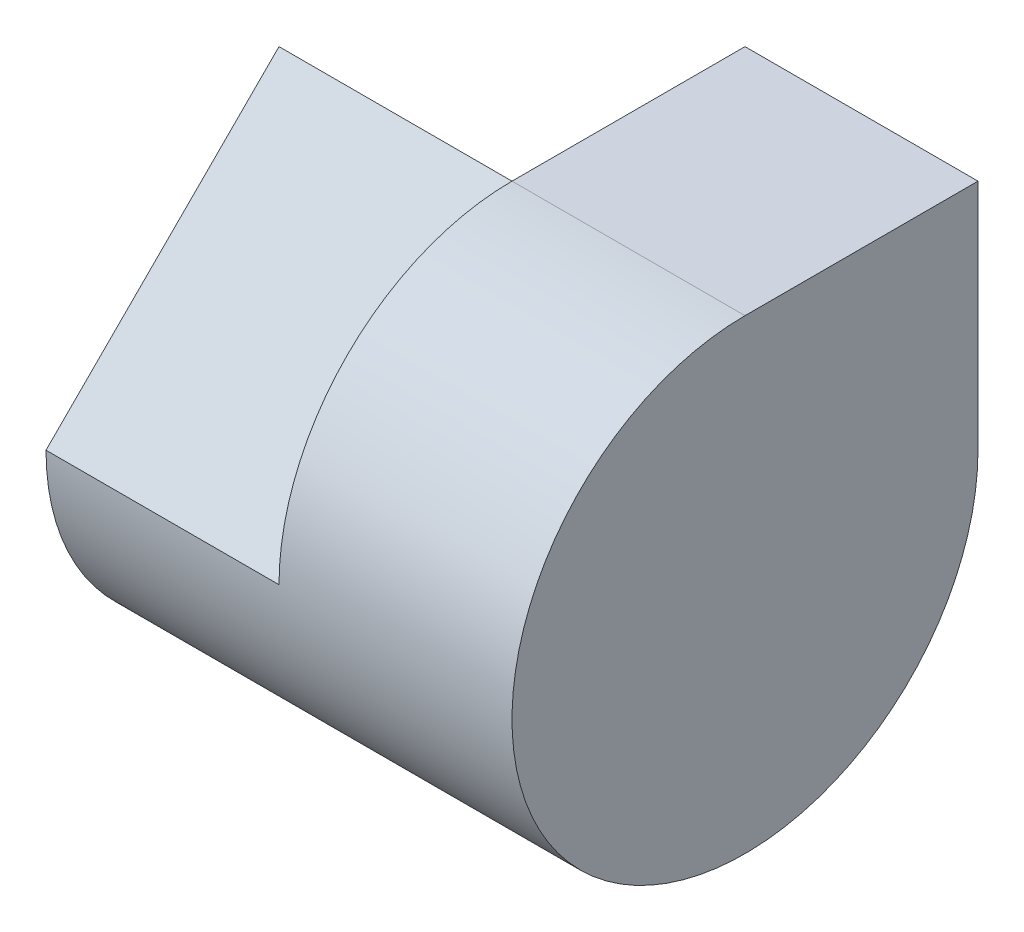
ISO-10303-21;
HEADER;
FILE_DESCRIPTION(('STEP AP214'),'2;1');
FILE_NAME('part.step','',(''),(''),'','','');
FILE_SCHEMA(('AUTOMOTIVE_DESIGN { 1 0 10303 214 1 1 1 1 }'));
ENDSEC;
DATA;
#1=APPLICATION_CONTEXT('core data for automotive mechanical design processes');
#2=APPLICATION_PROTOCOL_DEFINITION('international standard','automotive_design',2000,#1);
#3=PRODUCT_CONTEXT('',#1,'mechanical');
#4=PRODUCT('Part','Part','',(#3));
#5=PRODUCT_RELATED_PRODUCT_CATEGORY('part','',(#4));
#6=PRODUCT_DEFINITION_FORMATION('','',#4);
#7=PRODUCT_DEFINITION_CONTEXT('part definition',#1,'design');
#8=PRODUCT_DEFINITION('design','',#6,#7);
#9=PRODUCT_DEFINITION_SHAPE('','',#8);
#10=(LENGTH_UNIT() NAMED_UNIT(*) SI_UNIT(.MILLI.,.METRE.));
#11=(NAMED_UNIT(*) PLANE_ANGLE_UNIT() SI_UNIT($,.RADIAN.));
#12=(NAMED_UNIT(*) SI_UNIT($,.STERADIAN.) SOLID_ANGLE_UNIT());
#13=UNCERTAINTY_MEASURE_WITH_UNIT(LENGTH_MEASURE(1.E-05),#10,'distance_accuracy_value','');
#14=(GEOMETRIC_REPRESENTATION_CONTEXT(3) GLOBAL_UNCERTAINTY_ASSIGNED_CONTEXT((#13)) GLOBAL_UNIT_ASSIGNED_CONTEXT((#10,
#11,#12)) REPRESENTATION_CONTEXT('',''));
#15=CARTESIAN_POINT('',(0.,0.,0.));
#16=DIRECTION('',(0.,0.,1.));
#17=DIRECTION('',(1.,0.,0.));
#18=AXIS2_PLACEMENT_3D('',#15,#16,#17);
#19=CARTESIAN_POINT('',(-2.,4.,2.));
#20=DIRECTION('',(1.,0.,0.));
#21=DIRECTION('',(0.,0.,-1.));
#22=AXIS2_PLACEMENT_3D('',#19,#20,#21);
#23=PLANE('',#22);
#24=CARTESIAN_POINT('',(-2.,2.,0.));
#25=DIRECTION('',(1.,0.,0.));
#26=DIRECTION('',(0.,0.,-1.));
#27=AXIS2_PLACEMENT_3D('',#24,#25,#26);
#28=CIRCLE('',#27,2.);
#29=CARTESIAN_POINT('',(-2.,2.,-2.));
#30=VERTEX_POINT('',#29);
#31=CARTESIAN_POINT('',(-2.,2.,2.));
#32=VERTEX_POINT('',#31);
#33=EDGE_CURVE('E140',#30,#32,#28,.F.);
#34=ORIENTED_EDGE('',*,*,#33,.T.);
#35=DIRECTION('',(0.,0.707106781186548,-0.707106781186548));
#36=VECTOR('',#35,1.);
#37=CARTESIAN_POINT('',(-2.,2.,2.));
#38=LINE('',#37,#36);
#39=CARTESIAN_POINT('',(-2.,4.,0.));
#40=VERTEX_POINT('',#39);
#41=EDGE_CURVE('E135',#32,#40,#38,.T.);
#42=ORIENTED_EDGE('',*,*,#41,.T.);
#43=DIRECTION('',(0.,-1.,0.));
#44=VECTOR('',#43,1.);
#45=CARTESIAN_POINT('',(-2.,0.,0.));
#46=LINE('',#45,#44);
#47=CARTESIAN_POINT('',(-2.,2.,0.));
#48=VERTEX_POINT('',#47);
#49=EDGE_CURVE('E149',#40,#48,#46,.T.);
#50=ORIENTED_EDGE('',*,*,#49,.T.);
#51=DIRECTION('',(0.,0.,-1.));
#52=VECTOR('',#51,1.);
#53=CARTESIAN_POINT('',(-2.,2.,0.));
#54=LINE('',#53,#52);
#55=EDGE_CURVE('E136',#48,#30,#54,.T.);
#56=ORIENTED_EDGE('',*,*,#55,.T.);
#57=EDGE_LOOP('',(#34,#42,#50,#56));
#58=FACE_BOUND('',#57,.T.);
#59=ADVANCED_FACE('F72',(#58),#23,.F.);
#60=CARTESIAN_POINT('',(2.,4.,2.));
#61=DIRECTION('',(-1.,0.,0.));
#62=DIRECTION('',(0.,0.,1.));
#63=AXIS2_PLACEMENT_3D('',#60,#61,#62);
#64=PLANE('',#63);
#65=DIRECTION('',(0.,0.,-1.));
#66=VECTOR('',#65,1.);
#67=CARTESIAN_POINT('',(2.,4.,2.));
#68=LINE('',#67,#66);
#69=CARTESIAN_POINT('',(2.,4.,0.));
#70=VERTEX_POINT('',#69);
#71=CARTESIAN_POINT('',(2.,4.,-2.));
#72=VERTEX_POINT('',#71);
#73=EDGE_CURVE('E93',#70,#72,#68,.T.);
#74=ORIENTED_EDGE('',*,*,#73,.F.);
#75=CARTESIAN_POINT('',(2.,2.,0.));
#76=DIRECTION('',(-1.,0.,0.));
#77=DIRECTION('',(0.,0.,1.));
#78=AXIS2_PLACEMENT_3D('',#75,#76,#77);
#79=CIRCLE('',#78,2.);
#80=CARTESIAN_POINT('',(2.,2.,-2.));
#81=VERTEX_POINT('',#80);
#82=EDGE_CURVE('E178',#70,#81,#79,.F.);
#83=ORIENTED_EDGE('',*,*,#82,.T.);
#84=DIRECTION('',(0.,-1.,0.));
#85=VECTOR('',#84,1.);
#86=CARTESIAN_POINT('',(2.,4.,-2.));
#87=LINE('',#86,#85);
#88=EDGE_CURVE('E80',#72,#81,#87,.T.);
#89=ORIENTED_EDGE('',*,*,#88,.F.);
#90=EDGE_LOOP('',(#74,#83,#89));
#91=FACE_BOUND('',#90,.T.);
#92=ADVANCED_FACE('F74',(#91),#64,.F.);
#93=CARTESIAN_POINT('',(-2.,4.,-2.));
#94=DIRECTION('',(0.,0.,1.));
#95=DIRECTION('',(1.,0.,0.));
#96=AXIS2_PLACEMENT_3D('',#93,#94,#95);
#97=PLANE('',#96);
#98=DIRECTION('',(-1.,0.,0.));
#99=VECTOR('',#98,1.);
#100=CARTESIAN_POINT('',(20.,2.,-2.));
#101=LINE('',#100,#99);
#102=CARTESIAN_POINT('',(0.,2.,-2.));
#103=VERTEX_POINT('',#102);
#104=EDGE_CURVE('E175',#81,#103,#101,.T.);
#105=ORIENTED_EDGE('',*,*,#104,.T.);
#106=DIRECTION('',(0.,-1.,0.));
#107=VECTOR('',#106,1.);
#108=CARTESIAN_POINT('',(0.,0.,-2.));
#109=LINE('',#108,#107);
#110=CARTESIAN_POINT('',(0.,4.,-2.));
#111=VERTEX_POINT('',#110);
#112=EDGE_CURVE('E153',#111,#103,#109,.T.);
#113=ORIENTED_EDGE('',*,*,#112,.F.);
#114=DIRECTION('',(-1.,0.,0.));
#115=VECTOR('',#114,1.);
#116=CARTESIAN_POINT('',(-2.,4.,-2.));
#117=LINE('',#116,#115);
#118=EDGE_CURVE('E168',#72,#111,#117,.T.);
#119=ORIENTED_EDGE('',*,*,#118,.F.);
#120=ORIENTED_EDGE('',*,*,#88,.T.);
#121=EDGE_LOOP('',(#105,#113,#119,#120));
#122=FACE_BOUND('',#121,.T.);
#123=ADVANCED_FACE('F173',(#122),#97,.F.);
#124=CARTESIAN_POINT('',(0.,0.,0.));
#125=DIRECTION('',(-1.,0.,0.));
#126=DIRECTION('',(0.,0.,1.));
#127=AXIS2_PLACEMENT_3D('',#124,#125,#126);
#128=PLANE('',#127);
#129=CARTESIAN_POINT('',(0.,2.,0.));
#130=DIRECTION('',(-1.,0.,0.));
#131=DIRECTION('',(0.,0.,1.));
#132=AXIS2_PLACEMENT_3D('',#129,#130,#131);
#133=CIRCLE('',#132,2.);
#134=CARTESIAN_POINT('',(0.,4.,0.));
#135=VERTEX_POINT('',#134);
#136=CARTESIAN_POINT('',(0.,2.,2.));
#137=VERTEX_POINT('',#136);
#138=EDGE_CURVE('E12',#135,#137,#133,.F.);
#139=ORIENTED_EDGE('',*,*,#138,.F.);
#140=DIRECTION('',(0.,0.707106781186548,-0.707106781186548));
#141=VECTOR('',#140,1.);
#142=CARTESIAN_POINT('',(0.,2.,2.));
#143=LINE('',#142,#141);
#144=EDGE_CURVE('E132',#137,#135,#143,.T.);
#145=ORIENTED_EDGE('',*,*,#144,.F.);
#146=EDGE_LOOP('',(#139,#145));
#147=FACE_BOUND('',#146,.T.);
#148=ADVANCED_FACE('F138',(#147),#128,.T.);
#149=CARTESIAN_POINT('',(0.,4.,0.));
#150=DIRECTION('',(0.,-1.,0.));
#151=DIRECTION('',(0.,0.,-1.));
#152=AXIS2_PLACEMENT_3D('',#149,#150,#151);
#153=PLANE('',#152);
#154=DIRECTION('',(0.,0.,-1.));
#155=VECTOR('',#154,1.);
#156=CARTESIAN_POINT('',(0.,4.,0.));
#157=LINE('',#156,#155);
#158=EDGE_CURVE('E151',#135,#111,#157,.T.);
#159=ORIENTED_EDGE('',*,*,#158,.F.);
#160=DIRECTION('',(-1.,0.,0.));
#161=VECTOR('',#160,1.);
#162=CARTESIAN_POINT('',(20.,4.,0.));
#163=LINE('',#162,#161);
#164=EDGE_CURVE('E86',#70,#135,#163,.T.);
#165=ORIENTED_EDGE('',*,*,#164,.F.);
#166=ORIENTED_EDGE('',*,*,#73,.T.);
#167=ORIENTED_EDGE('',*,*,#118,.T.);
#168=EDGE_LOOP('',(#159,#165,#166,#167));
#169=FACE_BOUND('',#168,.T.);
#170=ADVANCED_FACE('F191',(#169),#153,.F.);
#171=CARTESIAN_POINT('',(0.,2.,0.));
#172=DIRECTION('',(0.,1.,0.));
#173=DIRECTION('',(0.,0.,1.));
#174=AXIS2_PLACEMENT_3D('',#171,#172,#173);
#175=PLANE('',#174);
#176=ORIENTED_EDGE('',*,*,#55,.F.);
#177=DIRECTION('',(-1.,0.,0.));
#178=VECTOR('',#177,1.);
#179=CARTESIAN_POINT('',(0.,2.,0.));
#180=LINE('',#179,#178);
#181=CARTESIAN_POINT('',(0.,2.,0.));
#182=VERTEX_POINT('',#181);
#183=EDGE_CURVE('E156',#182,#48,#180,.T.);
#184=ORIENTED_EDGE('',*,*,#183,.F.);
#185=DIRECTION('',(0.,0.,-1.));
#186=VECTOR('',#185,1.);
#187=CARTESIAN_POINT('',(0.,2.,0.));
#188=LINE('',#187,#186);
#189=EDGE_CURVE('E145',#182,#103,#188,.T.);
#190=ORIENTED_EDGE('',*,*,#189,.T.);
#191=DIRECTION('',(-1.,0.,0.));
#192=VECTOR('',#191,1.);
#193=CARTESIAN_POINT('',(0.,2.,-2.));
#194=LINE('',#193,#192);
#195=EDGE_CURVE('E161',#103,#30,#194,.T.);
#196=ORIENTED_EDGE('',*,*,#195,.T.);
#197=EDGE_LOOP('',(#176,#184,#190,#196));
#198=FACE_BOUND('',#197,.T.);
#199=ADVANCED_FACE('F185',(#198),#175,.T.);
#200=CARTESIAN_POINT('',(0.,0.,0.));
#201=DIRECTION('',(0.,0.,-1.));
#202=DIRECTION('',(-1.,0.,0.));
#203=AXIS2_PLACEMENT_3D('',#200,#201,#202);
#204=PLANE('',#203);
#205=ORIENTED_EDGE('',*,*,#49,.F.);
#206=DIRECTION('',(-1.,0.,0.));
#207=VECTOR('',#206,1.);
#208=CARTESIAN_POINT('',(0.,4.,0.));
#209=LINE('',#208,#207);
#210=EDGE_CURVE('E164',#135,#40,#209,.T.);
#211=ORIENTED_EDGE('',*,*,#210,.F.);
#212=DIRECTION('',(0.,-1.,0.));
#213=VECTOR('',#212,1.);
#214=CARTESIAN_POINT('',(0.,0.,0.));
#215=LINE('',#214,#213);
#216=EDGE_CURVE('E148',#135,#182,#215,.T.);
#217=ORIENTED_EDGE('',*,*,#216,.T.);
#218=ORIENTED_EDGE('',*,*,#183,.T.);
#219=EDGE_LOOP('',(#205,#211,#217,#218));
#220=FACE_BOUND('',#219,.T.);
#221=ADVANCED_FACE('F199',(#220),#204,.T.);
#222=CARTESIAN_POINT('',(0.,0.,0.));
#223=DIRECTION('',(-1.,0.,0.));
#224=DIRECTION('',(0.,0.,1.));
#225=AXIS2_PLACEMENT_3D('',#222,#223,#224);
#226=PLANE('',#225);
#227=ORIENTED_EDGE('',*,*,#189,.F.);
#228=ORIENTED_EDGE('',*,*,#216,.F.);
#229=ORIENTED_EDGE('',*,*,#158,.T.);
#230=ORIENTED_EDGE('',*,*,#112,.T.);
#231=EDGE_LOOP('',(#227,#228,#229,#230));
#232=FACE_BOUND('',#231,.T.);
#233=ADVANCED_FACE('F189',(#232),#226,.T.);
#234=CARTESIAN_POINT('',(0.,2.,2.));
#235=DIRECTION('',(0.,0.707106781186547,0.707106781186547));
#236=DIRECTION('',(0.,-0.707106781186548,0.707106781186548));
#237=AXIS2_PLACEMENT_3D('',#234,#235,#236);
#238=PLANE('',#237);
#239=ORIENTED_EDGE('',*,*,#41,.F.);
#240=DIRECTION('',(-1.,0.,0.));
#241=VECTOR('',#240,1.);
#242=CARTESIAN_POINT('',(0.,2.,2.));
#243=LINE('',#242,#241);
#244=EDGE_CURVE('E125',#137,#32,#243,.T.);
#245=ORIENTED_EDGE('',*,*,#244,.F.);
#246=ORIENTED_EDGE('',*,*,#144,.T.);
#247=ORIENTED_EDGE('',*,*,#210,.T.);
#248=EDGE_LOOP('',(#239,#245,#246,#247));
#249=FACE_BOUND('',#248,.T.);
#250=ADVANCED_FACE('F131',(#249),#238,.T.);
#251=CARTESIAN_POINT('',(20.,2.,0.));
#252=DIRECTION('',(-1.,0.,0.));
#253=DIRECTION('',(0.,0.,1.));
#254=AXIS2_PLACEMENT_3D('',#251,#252,#253);
#255=CYLINDRICAL_SURFACE('',#254,2.);
#256=ORIENTED_EDGE('',*,*,#195,.F.);
#257=ORIENTED_EDGE('',*,*,#104,.F.);
#258=ORIENTED_EDGE('',*,*,#82,.F.);
#259=ORIENTED_EDGE('',*,*,#164,.T.);
#260=ORIENTED_EDGE('',*,*,#138,.T.);
#261=ORIENTED_EDGE('',*,*,#244,.T.);
#262=ORIENTED_EDGE('',*,*,#33,.F.);
#263=EDGE_LOOP('',(#256,#257,#258,#259,#260,#261,#262));
#264=FACE_BOUND('',#263,.T.);
#265=ADVANCED_FACE('F124',(#264),#255,.T.);
#266=CLOSED_SHELL('',(#59,#92,#123,#148,#170,#199,#221,#233,#250,#265));
#267=MANIFOLD_SOLID_BREP('B2',#266);
#268=ADVANCED_BREP_SHAPE_REPRESENTATION('',(#18,#267),#14);
#269=SHAPE_DEFINITION_REPRESENTATION(#9,#268);
ENDSEC;
END-ISO-10303-21;
